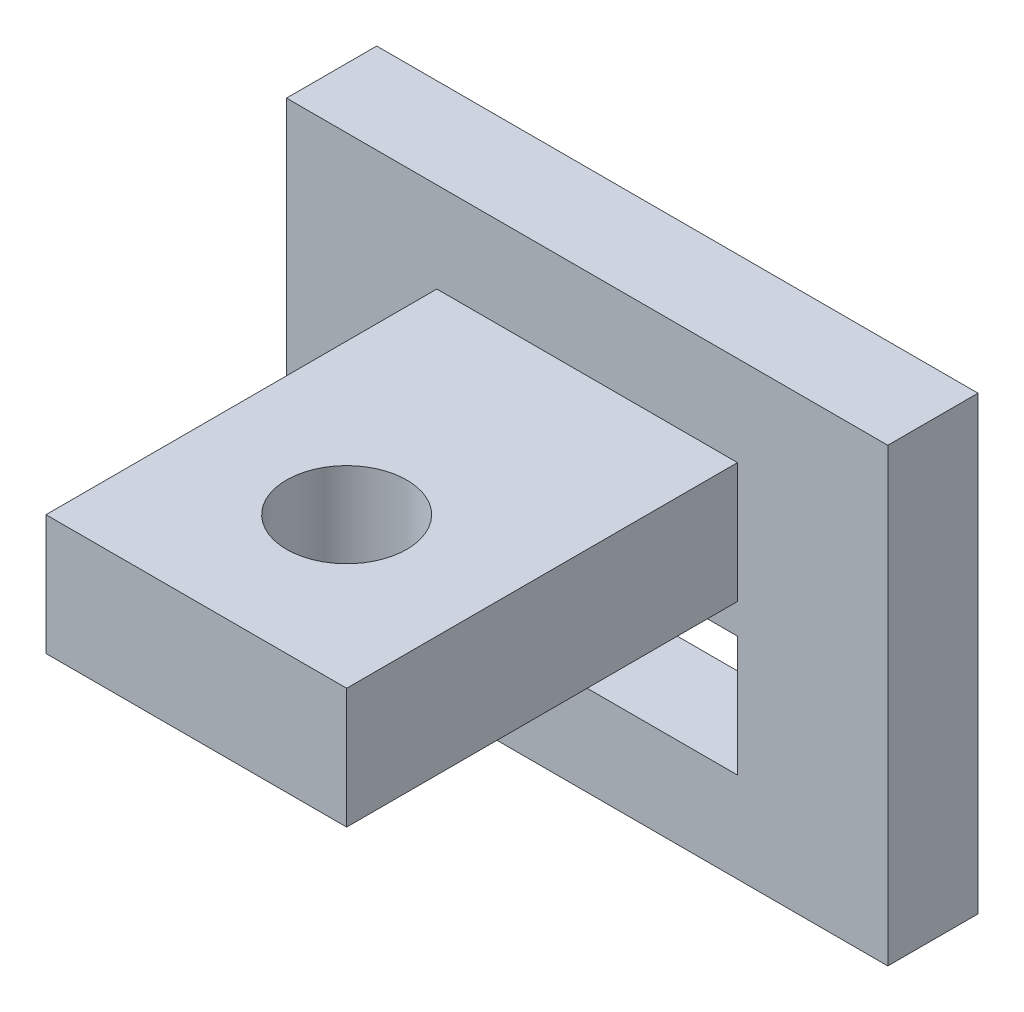
ISO-10303-21;
HEADER;
FILE_DESCRIPTION(('STEP AP214'),'2;1');
FILE_NAME('part.step','',(''),(''),'','','');
FILE_SCHEMA(('AUTOMOTIVE_DESIGN { 1 0 10303 214 1 1 1 1 }'));
ENDSEC;
DATA;
#1=APPLICATION_CONTEXT('core data for automotive mechanical design processes');
#2=APPLICATION_PROTOCOL_DEFINITION('international standard','automotive_design',2000,#1);
#3=PRODUCT_CONTEXT('',#1,'mechanical');
#4=PRODUCT('Part','Part','',(#3));
#5=PRODUCT_RELATED_PRODUCT_CATEGORY('part','',(#4));
#6=PRODUCT_DEFINITION_FORMATION('','',#4);
#7=PRODUCT_DEFINITION_CONTEXT('part definition',#1,'design');
#8=PRODUCT_DEFINITION('design','',#6,#7);
#9=PRODUCT_DEFINITION_SHAPE('','',#8);
#10=(LENGTH_UNIT() NAMED_UNIT(*) SI_UNIT(.MILLI.,.METRE.));
#11=(NAMED_UNIT(*) PLANE_ANGLE_UNIT() SI_UNIT($,.RADIAN.));
#12=(NAMED_UNIT(*) SI_UNIT($,.STERADIAN.) SOLID_ANGLE_UNIT());
#13=UNCERTAINTY_MEASURE_WITH_UNIT(LENGTH_MEASURE(1.E-05),#10,'distance_accuracy_value','');
#14=(GEOMETRIC_REPRESENTATION_CONTEXT(3) GLOBAL_UNCERTAINTY_ASSIGNED_CONTEXT((#13)) GLOBAL_UNIT_ASSIGNED_CONTEXT((#10,
#11,#12)) REPRESENTATION_CONTEXT('',''));
#15=CARTESIAN_POINT('',(0.,0.,0.));
#16=DIRECTION('',(0.,0.,1.));
#17=DIRECTION('',(1.,0.,0.));
#18=AXIS2_PLACEMENT_3D('',#15,#16,#17);
#19=CARTESIAN_POINT('',(0.,15.,3.));
#20=DIRECTION('',(0.,0.,1.));
#21=DIRECTION('',(1.,0.,0.));
#22=AXIS2_PLACEMENT_3D('',#19,#20,#21);
#23=PLANE('',#22);
#24=DIRECTION('',(0.,-1.,0.));
#25=VECTOR('',#24,1.);
#26=CARTESIAN_POINT('',(-15.,7.,3.));
#27=LINE('',#26,#25);
#28=CARTESIAN_POINT('',(-15.,7.,3.));
#29=VERTEX_POINT('',#28);
#30=CARTESIAN_POINT('',(-15.,3.,3.));
#31=VERTEX_POINT('',#30);
#32=EDGE_CURVE('E46',#29,#31,#27,.T.);
#33=ORIENTED_EDGE('',*,*,#32,.F.);
#34=DIRECTION('',(-1.,0.,0.));
#35=VECTOR('',#34,1.);
#36=CARTESIAN_POINT('',(-15.,7.,3.));
#37=LINE('',#36,#35);
#38=CARTESIAN_POINT('',(-5.,7.,3.));
#39=VERTEX_POINT('',#38);
#40=EDGE_CURVE('E138',#39,#29,#37,.T.);
#41=ORIENTED_EDGE('',*,*,#40,.F.);
#42=DIRECTION('',(0.,1.,0.));
#43=VECTOR('',#42,1.);
#44=CARTESIAN_POINT('',(-5.,7.,3.));
#45=LINE('',#44,#43);
#46=CARTESIAN_POINT('',(-5.,3.,3.));
#47=VERTEX_POINT('',#46);
#48=EDGE_CURVE('E141',#47,#39,#45,.T.);
#49=ORIENTED_EDGE('',*,*,#48,.F.);
#50=DIRECTION('',(1.,0.,0.));
#51=VECTOR('',#50,1.);
#52=CARTESIAN_POINT('',(-15.,3.,3.));
#53=LINE('',#52,#51);
#54=EDGE_CURVE('E150',#31,#47,#53,.T.);
#55=ORIENTED_EDGE('',*,*,#54,.F.);
#56=EDGE_LOOP('',(#33,#41,#49,#55));
#57=FACE_BOUND('',#56,.T.);
#58=DIRECTION('',(0.,1.,0.));
#59=VECTOR('',#58,1.);
#60=CARTESIAN_POINT('',(0.,0.,3.));
#61=LINE('',#60,#59);
#62=CARTESIAN_POINT('',(0.,0.,3.));
#63=VERTEX_POINT('',#62);
#64=CARTESIAN_POINT('',(0.,15.,3.));
#65=VERTEX_POINT('',#64);
#66=EDGE_CURVE('E189',#63,#65,#61,.T.);
#67=ORIENTED_EDGE('',*,*,#66,.T.);
#68=DIRECTION('',(-1.,0.,0.));
#69=VECTOR('',#68,1.);
#70=CARTESIAN_POINT('',(0.,15.,3.));
#71=LINE('',#70,#69);
#72=CARTESIAN_POINT('',(-20.,15.,3.));
#73=VERTEX_POINT('',#72);
#74=EDGE_CURVE('E192',#65,#73,#71,.T.);
#75=ORIENTED_EDGE('',*,*,#74,.T.);
#76=DIRECTION('',(0.,-1.,0.));
#77=VECTOR('',#76,1.);
#78=CARTESIAN_POINT('',(-20.,0.,3.));
#79=LINE('',#78,#77);
#80=CARTESIAN_POINT('',(-20.,0.,3.));
#81=VERTEX_POINT('',#80);
#82=EDGE_CURVE('E195',#73,#81,#79,.T.);
#83=ORIENTED_EDGE('',*,*,#82,.T.);
#84=DIRECTION('',(1.,0.,0.));
#85=VECTOR('',#84,1.);
#86=CARTESIAN_POINT('',(0.,0.,3.));
#87=LINE('',#86,#85);
#88=EDGE_CURVE('E197',#81,#63,#87,.T.);
#89=ORIENTED_EDGE('',*,*,#88,.T.);
#90=EDGE_LOOP('',(#67,#75,#83,#89));
#91=FACE_BOUND('',#90,.T.);
#92=DIRECTION('',(1.,0.,0.));
#93=VECTOR('',#92,1.);
#94=CARTESIAN_POINT('',(-15.,8.,3.));
#95=LINE('',#94,#93);
#96=CARTESIAN_POINT('',(-15.,8.,3.));
#97=VERTEX_POINT('',#96);
#98=CARTESIAN_POINT('',(-5.,8.,3.));
#99=VERTEX_POINT('',#98);
#100=EDGE_CURVE('E173',#97,#99,#95,.T.);
#101=ORIENTED_EDGE('',*,*,#100,.F.);
#102=DIRECTION('',(0.,-1.,0.));
#103=VECTOR('',#102,1.);
#104=CARTESIAN_POINT('',(-15.,12.,3.));
#105=LINE('',#104,#103);
#106=CARTESIAN_POINT('',(-15.,12.,3.));
#107=VERTEX_POINT('',#106);
#108=EDGE_CURVE('E156',#107,#97,#105,.T.);
#109=ORIENTED_EDGE('',*,*,#108,.F.);
#110=DIRECTION('',(-1.,0.,0.));
#111=VECTOR('',#110,1.);
#112=CARTESIAN_POINT('',(-15.,12.,3.));
#113=LINE('',#112,#111);
#114=CARTESIAN_POINT('',(-5.,12.,3.));
#115=VERTEX_POINT('',#114);
#116=EDGE_CURVE('E164',#115,#107,#113,.T.);
#117=ORIENTED_EDGE('',*,*,#116,.F.);
#118=DIRECTION('',(0.,1.,0.));
#119=VECTOR('',#118,1.);
#120=CARTESIAN_POINT('',(-5.,12.,3.));
#121=LINE('',#120,#119);
#122=EDGE_CURVE('E175',#99,#115,#121,.T.);
#123=ORIENTED_EDGE('',*,*,#122,.F.);
#124=EDGE_LOOP('',(#101,#109,#117,#123));
#125=FACE_BOUND('',#124,.T.);
#126=ADVANCED_FACE('F31',(#57,#91,#125),#23,.T.);
#127=CARTESIAN_POINT('',(0.,0.,3.));
#128=DIRECTION('',(-1.,0.,0.));
#129=DIRECTION('',(0.,-1.,0.));
#130=AXIS2_PLACEMENT_3D('',#127,#128,#129);
#131=PLANE('',#130);
#132=DIRECTION('',(0.,1.,0.));
#133=VECTOR('',#132,1.);
#134=CARTESIAN_POINT('',(0.,0.,0.));
#135=LINE('',#134,#133);
#136=CARTESIAN_POINT('',(0.,0.,0.));
#137=VERTEX_POINT('',#136);
#138=CARTESIAN_POINT('',(0.,15.,0.));
#139=VERTEX_POINT('',#138);
#140=EDGE_CURVE('E188',#137,#139,#135,.T.);
#141=ORIENTED_EDGE('',*,*,#140,.T.);
#142=DIRECTION('',(0.,0.,-1.));
#143=VECTOR('',#142,1.);
#144=CARTESIAN_POINT('',(0.,15.,3.));
#145=LINE('',#144,#143);
#146=EDGE_CURVE('E11',#65,#139,#145,.T.);
#147=ORIENTED_EDGE('',*,*,#146,.F.);
#148=ORIENTED_EDGE('',*,*,#66,.F.);
#149=DIRECTION('',(0.,0.,-1.));
#150=VECTOR('',#149,1.);
#151=CARTESIAN_POINT('',(0.,0.,3.));
#152=LINE('',#151,#150);
#153=EDGE_CURVE('E199',#63,#137,#152,.T.);
#154=ORIENTED_EDGE('',*,*,#153,.T.);
#155=EDGE_LOOP('',(#141,#147,#148,#154));
#156=FACE_BOUND('',#155,.T.);
#157=ADVANCED_FACE('F33',(#156),#131,.F.);
#158=CARTESIAN_POINT('',(0.,15.,3.));
#159=DIRECTION('',(0.,-1.,0.));
#160=DIRECTION('',(1.,0.,0.));
#161=AXIS2_PLACEMENT_3D('',#158,#159,#160);
#162=PLANE('',#161);
#163=DIRECTION('',(-1.,0.,0.));
#164=VECTOR('',#163,1.);
#165=CARTESIAN_POINT('',(0.,15.,0.));
#166=LINE('',#165,#164);
#167=CARTESIAN_POINT('',(-20.,15.,0.));
#168=VERTEX_POINT('',#167);
#169=EDGE_CURVE('E202',#139,#168,#166,.T.);
#170=ORIENTED_EDGE('',*,*,#169,.T.);
#171=DIRECTION('',(0.,0.,-1.));
#172=VECTOR('',#171,1.);
#173=CARTESIAN_POINT('',(-20.,15.,3.));
#174=LINE('',#173,#172);
#175=EDGE_CURVE('E39',#73,#168,#174,.T.);
#176=ORIENTED_EDGE('',*,*,#175,.F.);
#177=ORIENTED_EDGE('',*,*,#74,.F.);
#178=ORIENTED_EDGE('',*,*,#146,.T.);
#179=EDGE_LOOP('',(#170,#176,#177,#178));
#180=FACE_BOUND('',#179,.T.);
#181=ADVANCED_FACE('F230',(#180),#162,.F.);
#182=CARTESIAN_POINT('',(-20.,0.,3.));
#183=DIRECTION('',(1.,0.,0.));
#184=DIRECTION('',(0.,0.,-1.));
#185=AXIS2_PLACEMENT_3D('',#182,#183,#184);
#186=PLANE('',#185);
#187=DIRECTION('',(0.,-1.,0.));
#188=VECTOR('',#187,1.);
#189=CARTESIAN_POINT('',(-20.,0.,0.));
#190=LINE('',#189,#188);
#191=CARTESIAN_POINT('',(-20.,0.,0.));
#192=VERTEX_POINT('',#191);
#193=EDGE_CURVE('E204',#168,#192,#190,.T.);
#194=ORIENTED_EDGE('',*,*,#193,.T.);
#195=DIRECTION('',(0.,0.,-1.));
#196=VECTOR('',#195,1.);
#197=CARTESIAN_POINT('',(-20.,0.,3.));
#198=LINE('',#197,#196);
#199=EDGE_CURVE('E209',#81,#192,#198,.T.);
#200=ORIENTED_EDGE('',*,*,#199,.F.);
#201=ORIENTED_EDGE('',*,*,#82,.F.);
#202=ORIENTED_EDGE('',*,*,#175,.T.);
#203=EDGE_LOOP('',(#194,#200,#201,#202));
#204=FACE_BOUND('',#203,.T.);
#205=ADVANCED_FACE('F216',(#204),#186,.F.);
#206=CARTESIAN_POINT('',(0.,0.,3.));
#207=DIRECTION('',(0.,1.,0.));
#208=DIRECTION('',(-1.,0.,0.));
#209=AXIS2_PLACEMENT_3D('',#206,#207,#208);
#210=PLANE('',#209);
#211=DIRECTION('',(1.,0.,0.));
#212=VECTOR('',#211,1.);
#213=CARTESIAN_POINT('',(0.,0.,0.));
#214=LINE('',#213,#212);
#215=EDGE_CURVE('E193',#192,#137,#214,.T.);
#216=ORIENTED_EDGE('',*,*,#215,.T.);
#217=ORIENTED_EDGE('',*,*,#153,.F.);
#218=ORIENTED_EDGE('',*,*,#88,.F.);
#219=ORIENTED_EDGE('',*,*,#199,.T.);
#220=EDGE_LOOP('',(#216,#217,#218,#219));
#221=FACE_BOUND('',#220,.T.);
#222=ADVANCED_FACE('F223',(#221),#210,.F.);
#223=CARTESIAN_POINT('',(0.,15.,0.));
#224=DIRECTION('',(0.,0.,1.));
#225=DIRECTION('',(1.,0.,0.));
#226=AXIS2_PLACEMENT_3D('',#223,#224,#225);
#227=PLANE('',#226);
#228=DIRECTION('',(-1.,0.,0.));
#229=VECTOR('',#228,1.);
#230=CARTESIAN_POINT('',(-15.,7.,0.));
#231=LINE('',#230,#229);
#232=CARTESIAN_POINT('',(-5.,7.,0.));
#233=VERTEX_POINT('',#232);
#234=CARTESIAN_POINT('',(-15.,7.,0.));
#235=VERTEX_POINT('',#234);
#236=EDGE_CURVE('E128',#233,#235,#231,.T.);
#237=ORIENTED_EDGE('',*,*,#236,.T.);
#238=DIRECTION('',(0.,-1.,0.));
#239=VECTOR('',#238,1.);
#240=CARTESIAN_POINT('',(-15.,7.,0.));
#241=LINE('',#240,#239);
#242=CARTESIAN_POINT('',(-15.,3.,0.));
#243=VERTEX_POINT('',#242);
#244=EDGE_CURVE('E122',#235,#243,#241,.T.);
#245=ORIENTED_EDGE('',*,*,#244,.T.);
#246=DIRECTION('',(1.,0.,0.));
#247=VECTOR('',#246,1.);
#248=CARTESIAN_POINT('',(-15.,3.,0.));
#249=LINE('',#248,#247);
#250=CARTESIAN_POINT('',(-5.,3.,0.));
#251=VERTEX_POINT('',#250);
#252=EDGE_CURVE('E131',#243,#251,#249,.T.);
#253=ORIENTED_EDGE('',*,*,#252,.T.);
#254=DIRECTION('',(0.,1.,0.));
#255=VECTOR('',#254,1.);
#256=CARTESIAN_POINT('',(-5.,7.,0.));
#257=LINE('',#256,#255);
#258=EDGE_CURVE('E54',#251,#233,#257,.T.);
#259=ORIENTED_EDGE('',*,*,#258,.T.);
#260=EDGE_LOOP('',(#237,#245,#253,#259));
#261=FACE_BOUND('',#260,.T.);
#262=ORIENTED_EDGE('',*,*,#140,.F.);
#263=ORIENTED_EDGE('',*,*,#215,.F.);
#264=ORIENTED_EDGE('',*,*,#193,.F.);
#265=ORIENTED_EDGE('',*,*,#169,.F.);
#266=EDGE_LOOP('',(#262,#263,#264,#265));
#267=FACE_BOUND('',#266,.T.);
#268=ADVANCED_FACE('F135',(#261,#267),#227,.F.);
#269=CARTESIAN_POINT('',(-15.,12.,16.));
#270=DIRECTION('',(1.,0.,0.));
#271=DIRECTION('',(0.,0.,-1.));
#272=AXIS2_PLACEMENT_3D('',#269,#270,#271);
#273=PLANE('',#272);
#274=ORIENTED_EDGE('',*,*,#108,.T.);
#275=DIRECTION('',(0.,0.,-1.));
#276=VECTOR('',#275,1.);
#277=CARTESIAN_POINT('',(-15.,8.,16.));
#278=LINE('',#277,#276);
#279=CARTESIAN_POINT('',(-15.,8.,16.));
#280=VERTEX_POINT('',#279);
#281=EDGE_CURVE('E186',#280,#97,#278,.T.);
#282=ORIENTED_EDGE('',*,*,#281,.F.);
#283=DIRECTION('',(0.,-1.,0.));
#284=VECTOR('',#283,1.);
#285=CARTESIAN_POINT('',(-15.,12.,16.));
#286=LINE('',#285,#284);
#287=CARTESIAN_POINT('',(-15.,12.,16.));
#288=VERTEX_POINT('',#287);
#289=EDGE_CURVE('E160',#288,#280,#286,.T.);
#290=ORIENTED_EDGE('',*,*,#289,.F.);
#291=DIRECTION('',(0.,0.,-1.));
#292=VECTOR('',#291,1.);
#293=CARTESIAN_POINT('',(-15.,12.,16.));
#294=LINE('',#293,#292);
#295=EDGE_CURVE('E170',#288,#107,#294,.T.);
#296=ORIENTED_EDGE('',*,*,#295,.T.);
#297=EDGE_LOOP('',(#274,#282,#290,#296));
#298=FACE_BOUND('',#297,.T.);
#299=ADVANCED_FACE('F244',(#298),#273,.F.);
#300=CARTESIAN_POINT('',(-15.,8.,16.));
#301=DIRECTION('',(0.,1.,0.));
#302=DIRECTION('',(0.,0.,1.));
#303=AXIS2_PLACEMENT_3D('',#300,#301,#302);
#304=PLANE('',#303);
#305=CARTESIAN_POINT('',(-10.,8.,11.));
#306=DIRECTION('',(0.,1.,0.));
#307=DIRECTION('',(0.,0.,1.));
#308=AXIS2_PLACEMENT_3D('',#305,#306,#307);
#309=CIRCLE('',#308,2.);
#310=CARTESIAN_POINT('',(-10.,8.,13.));
#311=VERTEX_POINT('',#310);
#312=EDGE_CURVE('E144',#311,#311,#309,.T.);
#313=ORIENTED_EDGE('',*,*,#312,.T.);
#314=EDGE_LOOP('',(#313));
#315=FACE_BOUND('',#314,.T.);
#316=ORIENTED_EDGE('',*,*,#100,.T.);
#317=DIRECTION('',(0.,0.,-1.));
#318=VECTOR('',#317,1.);
#319=CARTESIAN_POINT('',(-5.,8.,16.));
#320=LINE('',#319,#318);
#321=CARTESIAN_POINT('',(-5.,8.,16.));
#322=VERTEX_POINT('',#321);
#323=EDGE_CURVE('E183',#322,#99,#320,.T.);
#324=ORIENTED_EDGE('',*,*,#323,.F.);
#325=DIRECTION('',(1.,0.,0.));
#326=VECTOR('',#325,1.);
#327=CARTESIAN_POINT('',(-15.,8.,16.));
#328=LINE('',#327,#326);
#329=EDGE_CURVE('E163',#280,#322,#328,.T.);
#330=ORIENTED_EDGE('',*,*,#329,.F.);
#331=ORIENTED_EDGE('',*,*,#281,.T.);
#332=EDGE_LOOP('',(#316,#324,#330,#331));
#333=FACE_BOUND('',#332,.T.);
#334=ADVANCED_FACE('F264',(#315,#333),#304,.F.);
#335=CARTESIAN_POINT('',(-5.,12.,16.));
#336=DIRECTION('',(-1.,0.,0.));
#337=DIRECTION('',(0.,0.,1.));
#338=AXIS2_PLACEMENT_3D('',#335,#336,#337);
#339=PLANE('',#338);
#340=ORIENTED_EDGE('',*,*,#122,.T.);
#341=DIRECTION('',(0.,0.,-1.));
#342=VECTOR('',#341,1.);
#343=CARTESIAN_POINT('',(-5.,12.,16.));
#344=LINE('',#343,#342);
#345=CARTESIAN_POINT('',(-5.,12.,16.));
#346=VERTEX_POINT('',#345);
#347=EDGE_CURVE('E181',#346,#115,#344,.T.);
#348=ORIENTED_EDGE('',*,*,#347,.F.);
#349=DIRECTION('',(0.,1.,0.));
#350=VECTOR('',#349,1.);
#351=CARTESIAN_POINT('',(-5.,12.,16.));
#352=LINE('',#351,#350);
#353=EDGE_CURVE('E166',#322,#346,#352,.T.);
#354=ORIENTED_EDGE('',*,*,#353,.F.);
#355=ORIENTED_EDGE('',*,*,#323,.T.);
#356=EDGE_LOOP('',(#340,#348,#354,#355));
#357=FACE_BOUND('',#356,.T.);
#358=ADVANCED_FACE('F272',(#357),#339,.F.);
#359=CARTESIAN_POINT('',(-15.,12.,16.));
#360=DIRECTION('',(0.,-1.,0.));
#361=DIRECTION('',(0.,0.,-1.));
#362=AXIS2_PLACEMENT_3D('',#359,#360,#361);
#363=PLANE('',#362);
#364=CARTESIAN_POINT('',(-10.,12.,11.));
#365=DIRECTION('',(0.,1.,0.));
#366=DIRECTION('',(0.,0.,1.));
#367=AXIS2_PLACEMENT_3D('',#364,#365,#366);
#368=CIRCLE('',#367,2.);
#369=CARTESIAN_POINT('',(-10.,12.,13.));
#370=VERTEX_POINT('',#369);
#371=EDGE_CURVE('E376',#370,#370,#368,.T.);
#372=ORIENTED_EDGE('',*,*,#371,.F.);
#373=EDGE_LOOP('',(#372));
#374=FACE_BOUND('',#373,.T.);
#375=ORIENTED_EDGE('',*,*,#116,.T.);
#376=ORIENTED_EDGE('',*,*,#295,.F.);
#377=DIRECTION('',(-1.,0.,0.));
#378=VECTOR('',#377,1.);
#379=CARTESIAN_POINT('',(-15.,12.,16.));
#380=LINE('',#379,#378);
#381=EDGE_CURVE('E168',#346,#288,#380,.T.);
#382=ORIENTED_EDGE('',*,*,#381,.F.);
#383=ORIENTED_EDGE('',*,*,#347,.T.);
#384=EDGE_LOOP('',(#375,#376,#382,#383));
#385=FACE_BOUND('',#384,.T.);
#386=ADVANCED_FACE('F280',(#374,#385),#363,.F.);
#387=CARTESIAN_POINT('',(-15.,8.,16.));
#388=DIRECTION('',(0.,0.,1.));
#389=DIRECTION('',(1.,0.,0.));
#390=AXIS2_PLACEMENT_3D('',#387,#388,#389);
#391=PLANE('',#390);
#392=ORIENTED_EDGE('',*,*,#289,.T.);
#393=ORIENTED_EDGE('',*,*,#329,.T.);
#394=ORIENTED_EDGE('',*,*,#353,.T.);
#395=ORIENTED_EDGE('',*,*,#381,.T.);
#396=EDGE_LOOP('',(#392,#393,#394,#395));
#397=FACE_BOUND('',#396,.T.);
#398=ADVANCED_FACE('F288',(#397),#391,.T.);
#399=CARTESIAN_POINT('',(-15.,7.,0.));
#400=DIRECTION('',(-1.,0.,0.));
#401=DIRECTION('',(0.,0.,1.));
#402=AXIS2_PLACEMENT_3D('',#399,#400,#401);
#403=PLANE('',#402);
#404=ORIENTED_EDGE('',*,*,#32,.T.);
#405=DIRECTION('',(0.,0.,1.));
#406=VECTOR('',#405,1.);
#407=CARTESIAN_POINT('',(-15.,3.,0.));
#408=LINE('',#407,#406);
#409=EDGE_CURVE('E118',#243,#31,#408,.T.);
#410=ORIENTED_EDGE('',*,*,#409,.F.);
#411=ORIENTED_EDGE('',*,*,#244,.F.);
#412=DIRECTION('',(0.,0.,1.));
#413=VECTOR('',#412,1.);
#414=CARTESIAN_POINT('',(-15.,7.,0.));
#415=LINE('',#414,#413);
#416=EDGE_CURVE('E154',#235,#29,#415,.T.);
#417=ORIENTED_EDGE('',*,*,#416,.T.);
#418=EDGE_LOOP('',(#404,#410,#411,#417));
#419=FACE_BOUND('',#418,.T.);
#420=ADVANCED_FACE('F120',(#419),#403,.F.);
#421=CARTESIAN_POINT('',(-15.,7.,0.));
#422=DIRECTION('',(0.,1.,0.));
#423=DIRECTION('',(0.,0.,1.));
#424=AXIS2_PLACEMENT_3D('',#421,#422,#423);
#425=PLANE('',#424);
#426=ORIENTED_EDGE('',*,*,#40,.T.);
#427=ORIENTED_EDGE('',*,*,#416,.F.);
#428=ORIENTED_EDGE('',*,*,#236,.F.);
#429=DIRECTION('',(0.,0.,1.));
#430=VECTOR('',#429,1.);
#431=CARTESIAN_POINT('',(-5.,7.,0.));
#432=LINE('',#431,#430);
#433=EDGE_CURVE('E157',#233,#39,#432,.T.);
#434=ORIENTED_EDGE('',*,*,#433,.T.);
#435=EDGE_LOOP('',(#426,#427,#428,#434));
#436=FACE_BOUND('',#435,.T.);
#437=ADVANCED_FACE('F302',(#436),#425,.F.);
#438=CARTESIAN_POINT('',(-5.,7.,0.));
#439=DIRECTION('',(1.,0.,0.));
#440=DIRECTION('',(0.,0.,-1.));
#441=AXIS2_PLACEMENT_3D('',#438,#439,#440);
#442=PLANE('',#441);
#443=ORIENTED_EDGE('',*,*,#48,.T.);
#444=ORIENTED_EDGE('',*,*,#433,.F.);
#445=ORIENTED_EDGE('',*,*,#258,.F.);
#446=DIRECTION('',(0.,0.,1.));
#447=VECTOR('',#446,1.);
#448=CARTESIAN_POINT('',(-5.,3.,0.));
#449=LINE('',#448,#447);
#450=EDGE_CURVE('E127',#251,#47,#449,.T.);
#451=ORIENTED_EDGE('',*,*,#450,.T.);
#452=EDGE_LOOP('',(#443,#444,#445,#451));
#453=FACE_BOUND('',#452,.T.);
#454=ADVANCED_FACE('F309',(#453),#442,.F.);
#455=CARTESIAN_POINT('',(-15.,3.,0.));
#456=DIRECTION('',(0.,-1.,0.));
#457=DIRECTION('',(0.,0.,-1.));
#458=AXIS2_PLACEMENT_3D('',#455,#456,#457);
#459=PLANE('',#458);
#460=ORIENTED_EDGE('',*,*,#54,.T.);
#461=ORIENTED_EDGE('',*,*,#450,.F.);
#462=ORIENTED_EDGE('',*,*,#252,.F.);
#463=ORIENTED_EDGE('',*,*,#409,.T.);
#464=EDGE_LOOP('',(#460,#461,#462,#463));
#465=FACE_BOUND('',#464,.T.);
#466=ADVANCED_FACE('F132',(#465),#459,.F.);
#467=CARTESIAN_POINT('',(-10.,0.,11.));
#468=DIRECTION('',(0.,1.,0.));
#469=DIRECTION('',(0.,0.,1.));
#470=AXIS2_PLACEMENT_3D('',#467,#468,#469);
#471=CYLINDRICAL_SURFACE('',#470,2.);
#472=ORIENTED_EDGE('',*,*,#371,.T.);
#473=EDGE_LOOP('',(#472));
#474=FACE_BOUND('',#473,.T.);
#475=ORIENTED_EDGE('',*,*,#312,.F.);
#476=EDGE_LOOP('',(#475));
#477=FACE_BOUND('',#476,.T.);
#478=ADVANCED_FACE('F322',(#474,#477),#471,.F.);
#479=CLOSED_SHELL('',(#126,#157,#181,#205,#222,#268,#299,#334,#358,#386,#398,#420,#437,#454,
#466,#478));
#480=MANIFOLD_SOLID_BREP('B2',#479);
#481=ADVANCED_BREP_SHAPE_REPRESENTATION('',(#18,#480),#14);
#482=SHAPE_DEFINITION_REPRESENTATION(#9,#481);
ENDSEC;
END-ISO-10303-21;
